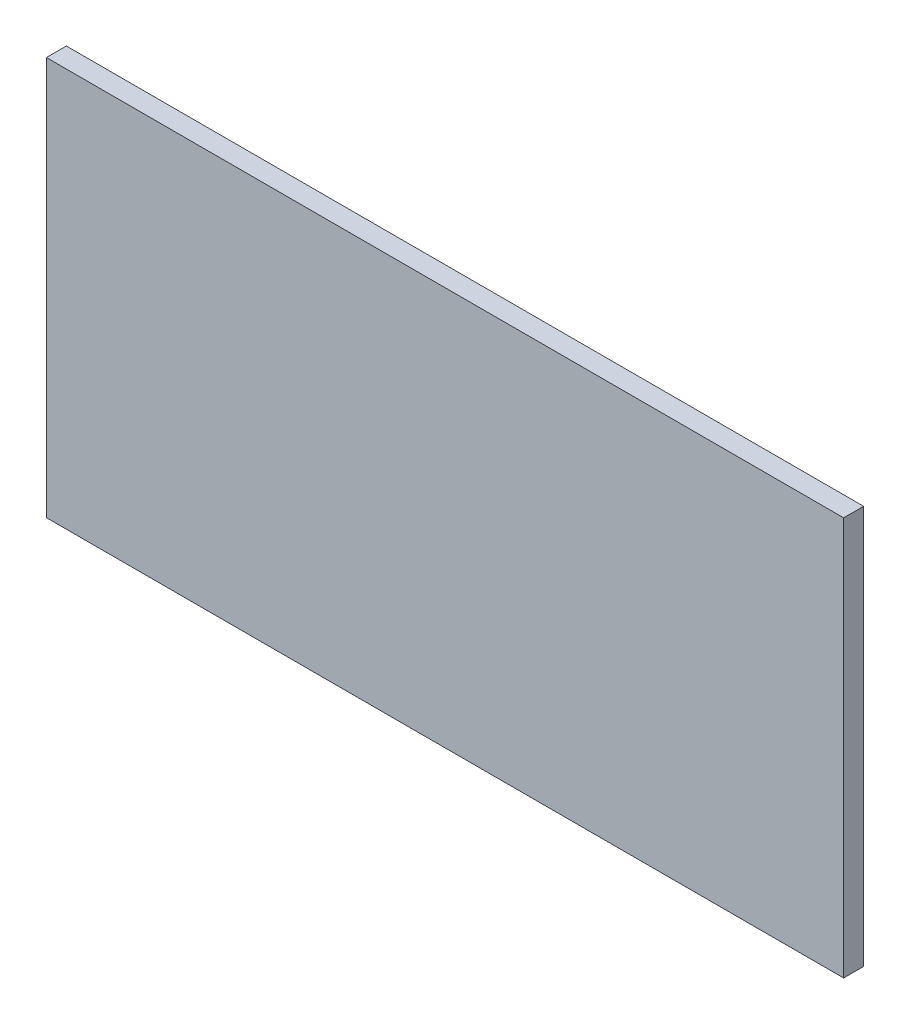
ISO-10303-21;
HEADER;
FILE_DESCRIPTION(('STEP AP214'),'2;1');
FILE_NAME('part.step','',(''),(''),'','','');
FILE_SCHEMA(('AUTOMOTIVE_DESIGN { 1 0 10303 214 1 1 1 1 }'));
ENDSEC;
DATA;
#1=APPLICATION_CONTEXT('core data for automotive mechanical design processes');
#2=APPLICATION_PROTOCOL_DEFINITION('international standard','automotive_design',2000,#1);
#3=PRODUCT_CONTEXT('',#1,'mechanical');
#4=PRODUCT('Part','Part','',(#3));
#5=PRODUCT_RELATED_PRODUCT_CATEGORY('part','',(#4));
#6=PRODUCT_DEFINITION_FORMATION('','',#4);
#7=PRODUCT_DEFINITION_CONTEXT('part definition',#1,'design');
#8=PRODUCT_DEFINITION('design','',#6,#7);
#9=PRODUCT_DEFINITION_SHAPE('','',#8);
#10=(LENGTH_UNIT() NAMED_UNIT(*) SI_UNIT(.MILLI.,.METRE.));
#11=(NAMED_UNIT(*) PLANE_ANGLE_UNIT() SI_UNIT($,.RADIAN.));
#12=(NAMED_UNIT(*) SI_UNIT($,.STERADIAN.) SOLID_ANGLE_UNIT());
#13=UNCERTAINTY_MEASURE_WITH_UNIT(LENGTH_MEASURE(1.E-05),#10,'distance_accuracy_value','');
#14=(GEOMETRIC_REPRESENTATION_CONTEXT(3) GLOBAL_UNCERTAINTY_ASSIGNED_CONTEXT((#13)) GLOBAL_UNIT_ASSIGNED_CONTEXT((#10,
#11,#12)) REPRESENTATION_CONTEXT('',''));
#15=CARTESIAN_POINT('',(0.,0.,0.));
#16=DIRECTION('',(0.,0.,1.));
#17=DIRECTION('',(1.,0.,0.));
#18=AXIS2_PLACEMENT_3D('',#15,#16,#17);
#19=CARTESIAN_POINT('',(1.269999998485E-06,0.,0.10009886));
#20=DIRECTION('',(0.,0.,1.));
#21=DIRECTION('',(1.,0.,0.));
#22=AXIS2_PLACEMENT_3D('',#19,#20,#21);
#23=PLANE('',#22);
#24=DIRECTION('',(0.,1.,0.));
#25=VECTOR('',#24,1.);
#26=CARTESIAN_POINT('',(1.99949308,-0.99949254,0.10009886));
#27=LINE('',#26,#25);
#28=CARTESIAN_POINT('',(1.99949308,-0.99949254,0.10009886));
#29=VERTEX_POINT('',#28);
#30=CARTESIAN_POINT('',(1.99949308,0.99949254,0.10009886));
#31=VERTEX_POINT('',#30);
#32=EDGE_CURVE('E76',#29,#31,#27,.T.);
#33=ORIENTED_EDGE('',*,*,#32,.T.);
#34=DIRECTION('',(1.,0.,0.));
#35=VECTOR('',#34,1.);
#36=CARTESIAN_POINT('',(1.99949308,0.99949254,0.10009886));
#37=LINE('',#36,#35);
#38=CARTESIAN_POINT('',(-1.99949054,0.99949254,0.10009886));
#39=VERTEX_POINT('',#38);
#40=EDGE_CURVE('E58',#31,#39,#37,.F.);
#41=ORIENTED_EDGE('',*,*,#40,.T.);
#42=DIRECTION('',(0.,1.,0.));
#43=VECTOR('',#42,1.);
#44=CARTESIAN_POINT('',(-1.99949054,0.99949254,0.10009886));
#45=LINE('',#44,#43);
#46=CARTESIAN_POINT('',(-1.99949054,-0.99949254,0.10009886));
#47=VERTEX_POINT('',#46);
#48=EDGE_CURVE('E20',#39,#47,#45,.F.);
#49=ORIENTED_EDGE('',*,*,#48,.T.);
#50=DIRECTION('',(1.,0.,0.));
#51=VECTOR('',#50,1.);
#52=CARTESIAN_POINT('',(-1.99949054,-0.99949254,0.10009886));
#53=LINE('',#52,#51);
#54=EDGE_CURVE('E55',#47,#29,#53,.T.);
#55=ORIENTED_EDGE('',*,*,#54,.T.);
#56=EDGE_LOOP('',(#33,#41,#49,#55));
#57=FACE_BOUND('',#56,.T.);
#58=ADVANCED_FACE('F17',(#57),#23,.T.);
#59=CARTESIAN_POINT('',(-1.99949054,0.99949254,0.));
#60=DIRECTION('',(1.,0.,0.));
#61=DIRECTION('',(0.,0.,-1.));
#62=AXIS2_PLACEMENT_3D('',#59,#60,#61);
#63=PLANE('',#62);
#64=DIRECTION('',(0.,0.,1.));
#65=VECTOR('',#64,1.);
#66=CARTESIAN_POINT('',(-1.99949054,-0.99949254,0.));
#67=LINE('',#66,#65);
#68=CARTESIAN_POINT('',(-1.99949054,-0.99949254,0.));
#69=VERTEX_POINT('',#68);
#70=EDGE_CURVE('E63',#69,#47,#67,.T.);
#71=ORIENTED_EDGE('',*,*,#70,.T.);
#72=ORIENTED_EDGE('',*,*,#48,.F.);
#73=DIRECTION('',(0.,0.,-1.));
#74=VECTOR('',#73,1.);
#75=CARTESIAN_POINT('',(-1.99949054,0.99949254,0.));
#76=LINE('',#75,#74);
#77=CARTESIAN_POINT('',(-1.99949054,0.99949254,0.));
#78=VERTEX_POINT('',#77);
#79=EDGE_CURVE('E80',#39,#78,#76,.T.);
#80=ORIENTED_EDGE('',*,*,#79,.T.);
#81=DIRECTION('',(0.,1.,0.));
#82=VECTOR('',#81,1.);
#83=CARTESIAN_POINT('',(-1.99949054,0.,0.));
#84=LINE('',#83,#82);
#85=EDGE_CURVE('E73',#78,#69,#84,.F.);
#86=ORIENTED_EDGE('',*,*,#85,.T.);
#87=EDGE_LOOP('',(#71,#72,#80,#86));
#88=FACE_BOUND('',#87,.T.);
#89=ADVANCED_FACE('F72',(#88),#63,.F.);
#90=CARTESIAN_POINT('',(-1.99949054,-0.99949254,0.));
#91=DIRECTION('',(0.,1.,0.));
#92=DIRECTION('',(0.,0.,1.));
#93=AXIS2_PLACEMENT_3D('',#90,#91,#92);
#94=PLANE('',#93);
#95=DIRECTION('',(0.,0.,1.));
#96=VECTOR('',#95,1.);
#97=CARTESIAN_POINT('',(1.99949308,-0.99949254,0.));
#98=LINE('',#97,#96);
#99=CARTESIAN_POINT('',(1.99949308,-0.99949254,0.));
#100=VERTEX_POINT('',#99);
#101=EDGE_CURVE('E69',#100,#29,#98,.T.);
#102=ORIENTED_EDGE('',*,*,#101,.T.);
#103=ORIENTED_EDGE('',*,*,#54,.F.);
#104=ORIENTED_EDGE('',*,*,#70,.F.);
#105=DIRECTION('',(1.,0.,0.));
#106=VECTOR('',#105,1.);
#107=CARTESIAN_POINT('',(1.269999998485E-06,-0.99949254,0.));
#108=LINE('',#107,#106);
#109=EDGE_CURVE('E83',#69,#100,#108,.T.);
#110=ORIENTED_EDGE('',*,*,#109,.T.);
#111=EDGE_LOOP('',(#102,#103,#104,#110));
#112=FACE_BOUND('',#111,.T.);
#113=ADVANCED_FACE('F66',(#112),#94,.F.);
#114=CARTESIAN_POINT('',(1.99949308,-0.99949254,0.));
#115=DIRECTION('',(-1.,0.,0.));
#116=DIRECTION('',(0.,0.,1.));
#117=AXIS2_PLACEMENT_3D('',#114,#115,#116);
#118=PLANE('',#117);
#119=DIRECTION('',(0.,0.,-1.));
#120=VECTOR('',#119,1.);
#121=CARTESIAN_POINT('',(1.99949308,0.99949254,0.));
#122=LINE('',#121,#120);
#123=CARTESIAN_POINT('',(1.99949308,0.99949254,0.));
#124=VERTEX_POINT('',#123);
#125=EDGE_CURVE('E34',#124,#31,#122,.F.);
#126=ORIENTED_EDGE('',*,*,#125,.T.);
#127=ORIENTED_EDGE('',*,*,#32,.F.);
#128=ORIENTED_EDGE('',*,*,#101,.F.);
#129=DIRECTION('',(0.,1.,0.));
#130=VECTOR('',#129,1.);
#131=CARTESIAN_POINT('',(1.99949308,0.,0.));
#132=LINE('',#131,#130);
#133=EDGE_CURVE('E26',#100,#124,#132,.T.);
#134=ORIENTED_EDGE('',*,*,#133,.T.);
#135=EDGE_LOOP('',(#126,#127,#128,#134));
#136=FACE_BOUND('',#135,.T.);
#137=ADVANCED_FACE('F88',(#136),#118,.F.);
#138=CARTESIAN_POINT('',(1.99949308,0.99949254,0.));
#139=DIRECTION('',(0.,-1.,0.));
#140=DIRECTION('',(0.,0.,-1.));
#141=AXIS2_PLACEMENT_3D('',#138,#139,#140);
#142=PLANE('',#141);
#143=ORIENTED_EDGE('',*,*,#79,.F.);
#144=ORIENTED_EDGE('',*,*,#40,.F.);
#145=ORIENTED_EDGE('',*,*,#125,.F.);
#146=DIRECTION('',(1.,0.,0.));
#147=VECTOR('',#146,1.);
#148=CARTESIAN_POINT('',(1.269999998485E-06,0.99949254,0.));
#149=LINE('',#148,#147);
#150=EDGE_CURVE('E11',#124,#78,#149,.F.);
#151=ORIENTED_EDGE('',*,*,#150,.T.);
#152=EDGE_LOOP('',(#143,#144,#145,#151));
#153=FACE_BOUND('',#152,.T.);
#154=ADVANCED_FACE('F91',(#153),#142,.F.);
#155=CARTESIAN_POINT('',(1.269999998485E-06,0.,0.));
#156=DIRECTION('',(0.,0.,1.));
#157=DIRECTION('',(1.,0.,0.));
#158=AXIS2_PLACEMENT_3D('',#155,#156,#157);
#159=PLANE('',#158);
#160=ORIENTED_EDGE('',*,*,#133,.F.);
#161=ORIENTED_EDGE('',*,*,#109,.F.);
#162=ORIENTED_EDGE('',*,*,#85,.F.);
#163=ORIENTED_EDGE('',*,*,#150,.F.);
#164=EDGE_LOOP('',(#160,#161,#162,#163));
#165=FACE_BOUND('',#164,.T.);
#166=ADVANCED_FACE('F90',(#165),#159,.F.);
#167=CLOSED_SHELL('',(#58,#89,#113,#137,#154,#166));
#168=MANIFOLD_SOLID_BREP('B1',#167);
#169=ADVANCED_BREP_SHAPE_REPRESENTATION('',(#18,#168),#14);
#170=SHAPE_DEFINITION_REPRESENTATION(#9,#169);
ENDSEC;
END-ISO-10303-21;
